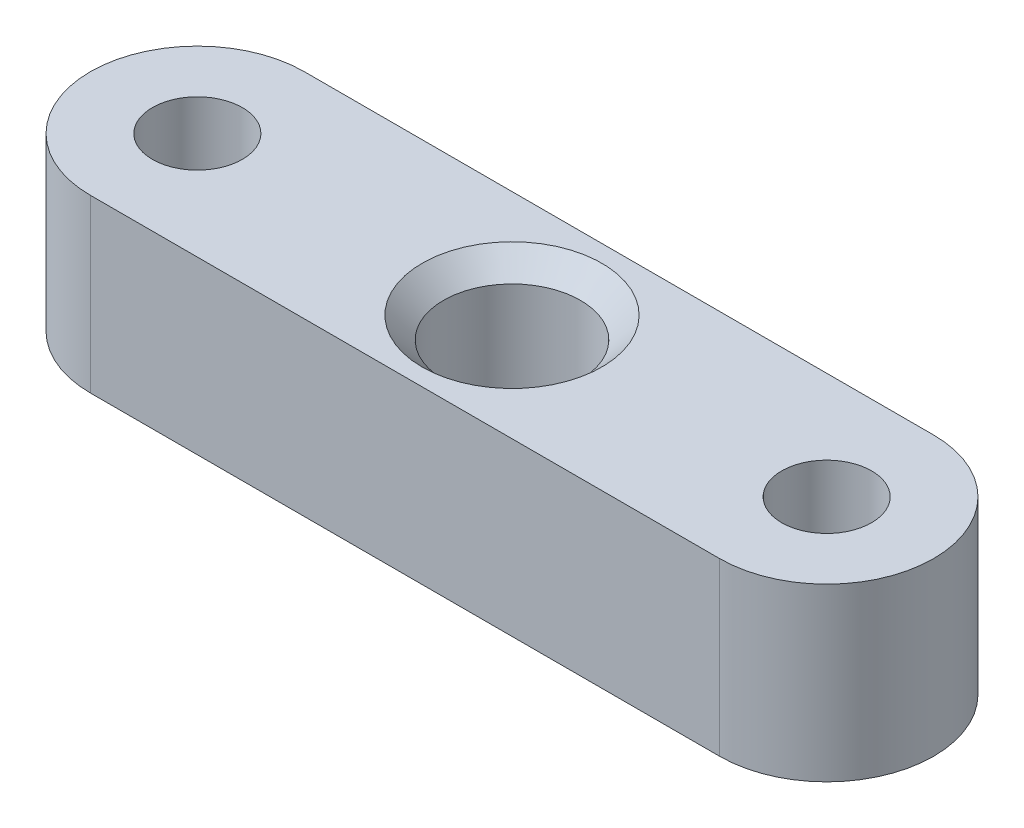
ISO-10303-21;
HEADER;
FILE_DESCRIPTION(('STEP AP214'),'2;1');
FILE_NAME('part.step','',(''),(''),'','','');
FILE_SCHEMA(('AUTOMOTIVE_DESIGN { 1 0 10303 214 1 1 1 1 }'));
ENDSEC;
DATA;
#1=APPLICATION_CONTEXT('core data for automotive mechanical design processes');
#2=APPLICATION_PROTOCOL_DEFINITION('international standard','automotive_design',2000,#1);
#3=PRODUCT_CONTEXT('',#1,'mechanical');
#4=PRODUCT('Part','Part','',(#3));
#5=PRODUCT_RELATED_PRODUCT_CATEGORY('part','',(#4));
#6=PRODUCT_DEFINITION_FORMATION('','',#4);
#7=PRODUCT_DEFINITION_CONTEXT('part definition',#1,'design');
#8=PRODUCT_DEFINITION('design','',#6,#7);
#9=PRODUCT_DEFINITION_SHAPE('','',#8);
#10=(LENGTH_UNIT() NAMED_UNIT(*) SI_UNIT(.MILLI.,.METRE.));
#11=(NAMED_UNIT(*) PLANE_ANGLE_UNIT() SI_UNIT($,.RADIAN.));
#12=(NAMED_UNIT(*) SI_UNIT($,.STERADIAN.) SOLID_ANGLE_UNIT());
#13=UNCERTAINTY_MEASURE_WITH_UNIT(LENGTH_MEASURE(1.E-05),#10,'distance_accuracy_value','');
#14=(GEOMETRIC_REPRESENTATION_CONTEXT(3) GLOBAL_UNCERTAINTY_ASSIGNED_CONTEXT((#13)) GLOBAL_UNIT_ASSIGNED_CONTEXT((#10,
#11,#12)) REPRESENTATION_CONTEXT('',''));
#15=CARTESIAN_POINT('',(0.,0.,0.));
#16=DIRECTION('',(0.,0.,1.));
#17=DIRECTION('',(1.,0.,0.));
#18=AXIS2_PLACEMENT_3D('',#15,#16,#17);
#19=CARTESIAN_POINT('',(0.,8.,5.));
#20=DIRECTION('',(0.,0.,-1.));
#21=DIRECTION('',(-1.,0.,0.));
#22=AXIS2_PLACEMENT_3D('',#19,#20,#21);
#23=PLANE('',#22);
#24=DIRECTION('',(1.,0.,0.));
#25=VECTOR('',#24,1.);
#26=CARTESIAN_POINT('',(0.,0.,5.));
#27=LINE('',#26,#25);
#28=CARTESIAN_POINT('',(-14.7,0.,5.));
#29=VERTEX_POINT('',#28);
#30=CARTESIAN_POINT('',(14.7,0.,4.99999999999999));
#31=VERTEX_POINT('',#30);
#32=EDGE_CURVE('E131',#29,#31,#27,.T.);
#33=ORIENTED_EDGE('',*,*,#32,.T.);
#34=DIRECTION('',(0.,-1.,0.));
#35=VECTOR('',#34,1.);
#36=CARTESIAN_POINT('',(14.7,8.,4.99999999999999));
#37=LINE('',#36,#35);
#38=CARTESIAN_POINT('',(14.7,8.,4.99999999999999));
#39=VERTEX_POINT('',#38);
#40=EDGE_CURVE('E112',#39,#31,#37,.T.);
#41=ORIENTED_EDGE('',*,*,#40,.F.);
#42=DIRECTION('',(1.,0.,0.));
#43=VECTOR('',#42,1.);
#44=CARTESIAN_POINT('',(0.,8.,5.));
#45=LINE('',#44,#43);
#46=CARTESIAN_POINT('',(-14.7,8.,5.));
#47=VERTEX_POINT('',#46);
#48=EDGE_CURVE('E100',#47,#39,#45,.T.);
#49=ORIENTED_EDGE('',*,*,#48,.F.);
#50=DIRECTION('',(0.,-1.,0.));
#51=VECTOR('',#50,1.);
#52=CARTESIAN_POINT('',(-14.7,8.,5.));
#53=LINE('',#52,#51);
#54=EDGE_CURVE('E118',#47,#29,#53,.T.);
#55=ORIENTED_EDGE('',*,*,#54,.T.);
#56=EDGE_LOOP('',(#33,#41,#49,#55));
#57=FACE_BOUND('',#56,.T.);
#58=ADVANCED_FACE('F49',(#57),#23,.F.);
#59=CARTESIAN_POINT('',(14.7,8.,0.));
#60=DIRECTION('',(0.,-1.,0.));
#61=DIRECTION('',(0.,0.,-1.));
#62=AXIS2_PLACEMENT_3D('',#59,#60,#61);
#63=CYLINDRICAL_SURFACE('',#62,5.);
#64=CARTESIAN_POINT('',(14.7,0.,0.));
#65=DIRECTION('',(0.,1.,0.));
#66=DIRECTION('',(0.,0.,1.));
#67=AXIS2_PLACEMENT_3D('',#64,#65,#66);
#68=CIRCLE('',#67,5.);
#69=CARTESIAN_POINT('',(14.7,0.,-5.00000000000001));
#70=VERTEX_POINT('',#69);
#71=EDGE_CURVE('E107',#31,#70,#68,.T.);
#72=ORIENTED_EDGE('',*,*,#71,.T.);
#73=DIRECTION('',(0.,-1.,0.));
#74=VECTOR('',#73,1.);
#75=CARTESIAN_POINT('',(14.7,8.,-5.00000000000001));
#76=LINE('',#75,#74);
#77=CARTESIAN_POINT('',(14.7,8.,-5.00000000000001));
#78=VERTEX_POINT('',#77);
#79=EDGE_CURVE('E105',#78,#70,#76,.T.);
#80=ORIENTED_EDGE('',*,*,#79,.F.);
#81=CARTESIAN_POINT('',(14.7,8.,0.));
#82=DIRECTION('',(0.,1.,0.));
#83=DIRECTION('',(0.,0.,1.));
#84=AXIS2_PLACEMENT_3D('',#81,#82,#83);
#85=CIRCLE('',#84,5.);
#86=EDGE_CURVE('E95',#39,#78,#85,.T.);
#87=ORIENTED_EDGE('',*,*,#86,.F.);
#88=ORIENTED_EDGE('',*,*,#40,.T.);
#89=EDGE_LOOP('',(#72,#80,#87,#88));
#90=FACE_BOUND('',#89,.T.);
#91=ADVANCED_FACE('F106',(#90),#63,.T.);
#92=CARTESIAN_POINT('',(0.,8.,-5.));
#93=DIRECTION('',(0.,0.,-1.));
#94=DIRECTION('',(-1.,0.,0.));
#95=AXIS2_PLACEMENT_3D('',#92,#93,#94);
#96=PLANE('',#95);
#97=DIRECTION('',(1.,0.,0.));
#98=VECTOR('',#97,1.);
#99=CARTESIAN_POINT('',(0.,0.,-5.));
#100=LINE('',#99,#98);
#101=CARTESIAN_POINT('',(-14.7,0.,-5.));
#102=VERTEX_POINT('',#101);
#103=EDGE_CURVE('E137',#102,#70,#100,.T.);
#104=ORIENTED_EDGE('',*,*,#103,.F.);
#105=DIRECTION('',(0.,-1.,0.));
#106=VECTOR('',#105,1.);
#107=CARTESIAN_POINT('',(-14.7,8.,-5.));
#108=LINE('',#107,#106);
#109=CARTESIAN_POINT('',(-14.7,8.,-5.));
#110=VERTEX_POINT('',#109);
#111=EDGE_CURVE('E84',#110,#102,#108,.T.);
#112=ORIENTED_EDGE('',*,*,#111,.F.);
#113=DIRECTION('',(1.,0.,0.));
#114=VECTOR('',#113,1.);
#115=CARTESIAN_POINT('',(0.,8.,-5.));
#116=LINE('',#115,#114);
#117=EDGE_CURVE('E98',#110,#78,#116,.T.);
#118=ORIENTED_EDGE('',*,*,#117,.T.);
#119=ORIENTED_EDGE('',*,*,#79,.T.);
#120=EDGE_LOOP('',(#104,#112,#118,#119));
#121=FACE_BOUND('',#120,.T.);
#122=ADVANCED_FACE('F114',(#121),#96,.T.);
#123=CARTESIAN_POINT('',(-14.7,8.,0.));
#124=DIRECTION('',(0.,-1.,0.));
#125=DIRECTION('',(0.,0.,-1.));
#126=AXIS2_PLACEMENT_3D('',#123,#124,#125);
#127=CYLINDRICAL_SURFACE('',#126,2.1);
#128=CARTESIAN_POINT('',(-14.7,8.,0.));
#129=DIRECTION('',(0.,1.,0.));
#130=DIRECTION('',(0.,0.,1.));
#131=AXIS2_PLACEMENT_3D('',#128,#129,#130);
#132=CIRCLE('',#131,2.1);
#133=CARTESIAN_POINT('',(-14.7,8.,2.1));
#134=VERTEX_POINT('',#133);
#135=EDGE_CURVE('E205',#134,#134,#132,.T.);
#136=ORIENTED_EDGE('',*,*,#135,.T.);
#137=EDGE_LOOP('',(#136));
#138=FACE_BOUND('',#137,.T.);
#139=CARTESIAN_POINT('',(-14.7,0.,0.));
#140=DIRECTION('',(0.,1.,0.));
#141=DIRECTION('',(0.,0.,1.));
#142=AXIS2_PLACEMENT_3D('',#139,#140,#141);
#143=CIRCLE('',#142,2.1);
#144=CARTESIAN_POINT('',(-14.7,0.,2.1));
#145=VERTEX_POINT('',#144);
#146=EDGE_CURVE('E126',#145,#145,#143,.T.);
#147=ORIENTED_EDGE('',*,*,#146,.F.);
#148=EDGE_LOOP('',(#147));
#149=FACE_BOUND('',#148,.T.);
#150=ADVANCED_FACE('F180',(#138,#149),#127,.F.);
#151=CARTESIAN_POINT('',(14.7,8.,0.));
#152=DIRECTION('',(0.,-1.,0.));
#153=DIRECTION('',(0.,0.,-1.));
#154=AXIS2_PLACEMENT_3D('',#151,#152,#153);
#155=CYLINDRICAL_SURFACE('',#154,2.1);
#156=CARTESIAN_POINT('',(14.7,8.,0.));
#157=DIRECTION('',(0.,1.,0.));
#158=DIRECTION('',(0.,0.,1.));
#159=AXIS2_PLACEMENT_3D('',#156,#157,#158);
#160=CIRCLE('',#159,2.1);
#161=CARTESIAN_POINT('',(14.7,8.,2.09999999999999));
#162=VERTEX_POINT('',#161);
#163=EDGE_CURVE('E142',#162,#162,#160,.T.);
#164=ORIENTED_EDGE('',*,*,#163,.T.);
#165=EDGE_LOOP('',(#164));
#166=FACE_BOUND('',#165,.T.);
#167=CARTESIAN_POINT('',(14.7,0.,0.));
#168=DIRECTION('',(0.,1.,0.));
#169=DIRECTION('',(0.,0.,1.));
#170=AXIS2_PLACEMENT_3D('',#167,#168,#169);
#171=CIRCLE('',#170,2.1);
#172=CARTESIAN_POINT('',(14.7,0.,2.09999999999999));
#173=VERTEX_POINT('',#172);
#174=EDGE_CURVE('E122',#173,#173,#171,.T.);
#175=ORIENTED_EDGE('',*,*,#174,.F.);
#176=EDGE_LOOP('',(#175));
#177=FACE_BOUND('',#176,.T.);
#178=ADVANCED_FACE('F182',(#166,#177),#155,.F.);
#179=CARTESIAN_POINT('',(-14.7,8.,0.));
#180=DIRECTION('',(0.,-1.,0.));
#181=DIRECTION('',(0.,0.,-1.));
#182=AXIS2_PLACEMENT_3D('',#179,#180,#181);
#183=CYLINDRICAL_SURFACE('',#182,5.);
#184=CARTESIAN_POINT('',(-14.7,0.,0.));
#185=DIRECTION('',(0.,1.,0.));
#186=DIRECTION('',(0.,0.,1.));
#187=AXIS2_PLACEMENT_3D('',#184,#185,#186);
#188=CIRCLE('',#187,5.);
#189=EDGE_CURVE('E87',#102,#29,#188,.T.);
#190=ORIENTED_EDGE('',*,*,#189,.T.);
#191=ORIENTED_EDGE('',*,*,#54,.F.);
#192=CARTESIAN_POINT('',(-14.7,8.,0.));
#193=DIRECTION('',(0.,1.,0.));
#194=DIRECTION('',(0.,0.,1.));
#195=AXIS2_PLACEMENT_3D('',#192,#193,#194);
#196=CIRCLE('',#195,5.);
#197=EDGE_CURVE('E68',#110,#47,#196,.T.);
#198=ORIENTED_EDGE('',*,*,#197,.F.);
#199=ORIENTED_EDGE('',*,*,#111,.T.);
#200=EDGE_LOOP('',(#190,#191,#198,#199));
#201=FACE_BOUND('',#200,.T.);
#202=ADVANCED_FACE('F185',(#201),#183,.T.);
#203=CARTESIAN_POINT('',(0.,8.,0.));
#204=DIRECTION('',(0.,1.,0.));
#205=DIRECTION('',(0.,0.,1.));
#206=AXIS2_PLACEMENT_3D('',#203,#204,#205);
#207=PLANE('',#206);
#208=CARTESIAN_POINT('',(0.,8.,0.));
#209=DIRECTION('',(0.,1.,0.));
#210=DIRECTION('',(0.,0.,1.));
#211=AXIS2_PLACEMENT_3D('',#208,#209,#210);
#212=CIRCLE('',#211,4.20000000000001);
#213=CARTESIAN_POINT('',(0.,8.,4.2));
#214=VERTEX_POINT('',#213);
#215=EDGE_CURVE('E11',#214,#214,#212,.F.);
#216=ORIENTED_EDGE('',*,*,#215,.T.);
#217=EDGE_LOOP('',(#216));
#218=FACE_BOUND('',#217,.T.);
#219=ORIENTED_EDGE('',*,*,#163,.F.);
#220=EDGE_LOOP('',(#219));
#221=FACE_BOUND('',#220,.T.);
#222=ORIENTED_EDGE('',*,*,#135,.F.);
#223=EDGE_LOOP('',(#222));
#224=FACE_BOUND('',#223,.T.);
#225=ORIENTED_EDGE('',*,*,#48,.T.);
#226=ORIENTED_EDGE('',*,*,#86,.T.);
#227=ORIENTED_EDGE('',*,*,#117,.F.);
#228=ORIENTED_EDGE('',*,*,#197,.T.);
#229=EDGE_LOOP('',(#225,#226,#227,#228));
#230=FACE_BOUND('',#229,.T.);
#231=ADVANCED_FACE('F96',(#218,#221,#224,#230),#207,.T.);
#232=CARTESIAN_POINT('',(0.,0.,0.));
#233=DIRECTION('',(0.,1.,0.));
#234=DIRECTION('',(0.,0.,1.));
#235=AXIS2_PLACEMENT_3D('',#232,#233,#234);
#236=PLANE('',#235);
#237=CARTESIAN_POINT('',(0.,0.,0.));
#238=DIRECTION('',(0.,-1.,0.));
#239=DIRECTION('',(0.,0.,-1.));
#240=AXIS2_PLACEMENT_3D('',#237,#238,#239);
#241=CIRCLE('',#240,2.);
#242=CARTESIAN_POINT('',(0.,0.,-2.));
#243=VERTEX_POINT('',#242);
#244=EDGE_CURVE('E152',#243,#243,#241,.T.);
#245=ORIENTED_EDGE('',*,*,#244,.F.);
#246=EDGE_LOOP('',(#245));
#247=FACE_BOUND('',#246,.T.);
#248=ORIENTED_EDGE('',*,*,#174,.T.);
#249=EDGE_LOOP('',(#248));
#250=FACE_BOUND('',#249,.T.);
#251=ORIENTED_EDGE('',*,*,#146,.T.);
#252=EDGE_LOOP('',(#251));
#253=FACE_BOUND('',#252,.T.);
#254=ORIENTED_EDGE('',*,*,#32,.F.);
#255=ORIENTED_EDGE('',*,*,#189,.F.);
#256=ORIENTED_EDGE('',*,*,#103,.T.);
#257=ORIENTED_EDGE('',*,*,#71,.F.);
#258=EDGE_LOOP('',(#254,#255,#256,#257));
#259=FACE_BOUND('',#258,.T.);
#260=ADVANCED_FACE('F196',(#247,#250,#253,#259),#236,.F.);
#261=CARTESIAN_POINT('',(0.,2.,0.));
#262=DIRECTION('',(0.,1.,0.));
#263=DIRECTION('',(0.,0.,1.));
#264=AXIS2_PLACEMENT_3D('',#261,#262,#263);
#265=CYLINDRICAL_SURFACE('',#264,3.2);
#266=CARTESIAN_POINT('',(0.,6.99999999999999,0.));
#267=DIRECTION('',(0.,1.,0.));
#268=DIRECTION('',(0.,0.,1.));
#269=AXIS2_PLACEMENT_3D('',#266,#267,#268);
#270=CIRCLE('',#269,3.2);
#271=CARTESIAN_POINT('',(0.,6.99999999999999,3.2));
#272=VERTEX_POINT('',#271);
#273=EDGE_CURVE('E60',#272,#272,#270,.T.);
#274=ORIENTED_EDGE('',*,*,#273,.T.);
#275=EDGE_LOOP('',(#274));
#276=FACE_BOUND('',#275,.T.);
#277=CARTESIAN_POINT('',(0.,2.,0.));
#278=DIRECTION('',(0.,1.,0.));
#279=DIRECTION('',(0.,0.,1.));
#280=AXIS2_PLACEMENT_3D('',#277,#278,#279);
#281=CIRCLE('',#280,3.2);
#282=CARTESIAN_POINT('',(0.,2.,3.2));
#283=VERTEX_POINT('',#282);
#284=EDGE_CURVE('E127',#283,#283,#281,.T.);
#285=ORIENTED_EDGE('',*,*,#284,.F.);
#286=EDGE_LOOP('',(#285));
#287=FACE_BOUND('',#286,.T.);
#288=ADVANCED_FACE('F157',(#276,#287),#265,.F.);
#289=CARTESIAN_POINT('',(0.,2.,0.));
#290=DIRECTION('',(0.,1.,0.));
#291=DIRECTION('',(0.,0.,1.));
#292=AXIS2_PLACEMENT_3D('',#289,#290,#291);
#293=PLANE('',#292);
#294=CARTESIAN_POINT('',(0.,2.,0.));
#295=DIRECTION('',(0.,1.,0.));
#296=DIRECTION('',(0.,0.,1.));
#297=AXIS2_PLACEMENT_3D('',#294,#295,#296);
#298=CIRCLE('',#297,2.);
#299=CARTESIAN_POINT('',(0.,2.,2.));
#300=VERTEX_POINT('',#299);
#301=EDGE_CURVE('E149',#300,#300,#298,.T.);
#302=ORIENTED_EDGE('',*,*,#301,.F.);
#303=EDGE_LOOP('',(#302));
#304=FACE_BOUND('',#303,.T.);
#305=ORIENTED_EDGE('',*,*,#284,.T.);
#306=EDGE_LOOP('',(#305));
#307=FACE_BOUND('',#306,.T.);
#308=ADVANCED_FACE('F167',(#304,#307),#293,.T.);
#309=CARTESIAN_POINT('',(0.,6.,0.));
#310=DIRECTION('',(0.,-1.,0.));
#311=DIRECTION('',(0.,0.,-1.));
#312=AXIS2_PLACEMENT_3D('',#309,#310,#311);
#313=CYLINDRICAL_SURFACE('',#312,2.);
#314=ORIENTED_EDGE('',*,*,#301,.T.);
#315=EDGE_LOOP('',(#314));
#316=FACE_BOUND('',#315,.T.);
#317=ORIENTED_EDGE('',*,*,#244,.T.);
#318=EDGE_LOOP('',(#317));
#319=FACE_BOUND('',#318,.T.);
#320=ADVANCED_FACE('F161',(#316,#319),#313,.F.);
#321=CARTESIAN_POINT('',(0.,6.99999999999999,0.));
#322=DIRECTION('',(0.,1.,0.));
#323=DIRECTION('',(0.,0.,1.));
#324=AXIS2_PLACEMENT_3D('',#321,#322,#323);
#325=CONICAL_SURFACE('',#324,3.2,0.785398163397448);
#326=ORIENTED_EDGE('',*,*,#215,.F.);
#327=EDGE_LOOP('',(#326));
#328=FACE_BOUND('',#327,.T.);
#329=ORIENTED_EDGE('',*,*,#273,.F.);
#330=EDGE_LOOP('',(#329));
#331=FACE_BOUND('',#330,.T.);
#332=ADVANCED_FACE('F52',(#328,#331),#325,.F.);
#333=CLOSED_SHELL('',(#58,#91,#122,#150,#178,#202,#231,#260,#288,#308,#320,#332));
#334=MANIFOLD_SOLID_BREP('B2',#333);
#335=ADVANCED_BREP_SHAPE_REPRESENTATION('',(#18,#334),#14);
#336=SHAPE_DEFINITION_REPRESENTATION(#9,#335);
ENDSEC;
END-ISO-10303-21;
